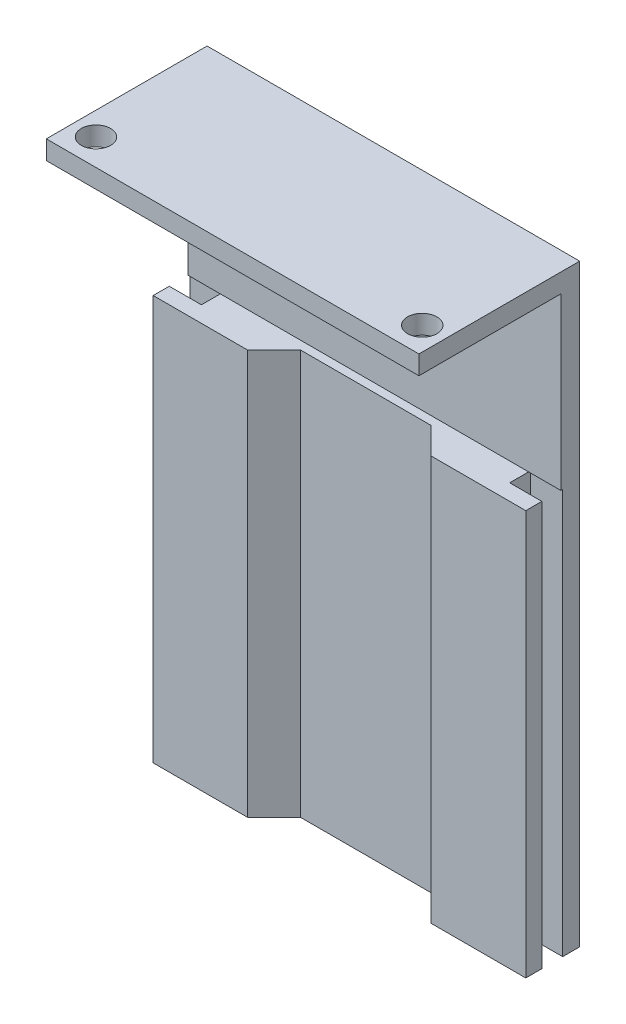
ISO-10303-21;
HEADER;
FILE_DESCRIPTION(('STEP AP214'),'2;1');
FILE_NAME('part.step','',(''),(''),'','','');
FILE_SCHEMA(('AUTOMOTIVE_DESIGN { 1 0 10303 214 1 1 1 1 }'));
ENDSEC;
DATA;
#1=APPLICATION_CONTEXT('core data for automotive mechanical design processes');
#2=APPLICATION_PROTOCOL_DEFINITION('international standard','automotive_design',2000,#1);
#3=PRODUCT_CONTEXT('',#1,'mechanical');
#4=PRODUCT('Part','Part','',(#3));
#5=PRODUCT_RELATED_PRODUCT_CATEGORY('part','',(#4));
#6=PRODUCT_DEFINITION_FORMATION('','',#4);
#7=PRODUCT_DEFINITION_CONTEXT('part definition',#1,'design');
#8=PRODUCT_DEFINITION('design','',#6,#7);
#9=PRODUCT_DEFINITION_SHAPE('','',#8);
#10=(LENGTH_UNIT() NAMED_UNIT(*) SI_UNIT(.MILLI.,.METRE.));
#11=(NAMED_UNIT(*) PLANE_ANGLE_UNIT() SI_UNIT($,.RADIAN.));
#12=(NAMED_UNIT(*) SI_UNIT($,.STERADIAN.) SOLID_ANGLE_UNIT());
#13=UNCERTAINTY_MEASURE_WITH_UNIT(LENGTH_MEASURE(1.E-05),#10,'distance_accuracy_value','');
#14=(GEOMETRIC_REPRESENTATION_CONTEXT(3) GLOBAL_UNCERTAINTY_ASSIGNED_CONTEXT((#13)) GLOBAL_UNIT_ASSIGNED_CONTEXT((#10,
#11,#12)) REPRESENTATION_CONTEXT('',''));
#15=CARTESIAN_POINT('',(0.,0.,0.));
#16=DIRECTION('',(0.,0.,1.));
#17=DIRECTION('',(1.,0.,0.));
#18=AXIS2_PLACEMENT_3D('',#15,#16,#17);
#19=CARTESIAN_POINT('',(19.7,46.,2.8));
#20=DIRECTION('',(0.,0.,-1.));
#21=DIRECTION('',(-1.,0.,0.));
#22=AXIS2_PLACEMENT_3D('',#19,#20,#21);
#23=PLANE('',#22);
#24=DIRECTION('',(0.,-1.,0.));
#25=VECTOR('',#24,1.);
#26=CARTESIAN_POINT('',(9.7,43.,2.79999999999999));
#27=LINE('',#26,#25);
#28=CARTESIAN_POINT('',(9.7,43.,2.79999999999999));
#29=VERTEX_POINT('',#28);
#30=CARTESIAN_POINT('',(9.7,0.199999999999999,2.8));
#31=VERTEX_POINT('',#30);
#32=EDGE_CURVE('E199',#29,#31,#27,.T.);
#33=ORIENTED_EDGE('',*,*,#32,.T.);
#34=DIRECTION('',(-1.,0.,0.));
#35=VECTOR('',#34,1.);
#36=CARTESIAN_POINT('',(19.7,0.2,2.8));
#37=LINE('',#36,#35);
#38=CARTESIAN_POINT('',(19.7,0.2,2.8));
#39=VERTEX_POINT('',#38);
#40=EDGE_CURVE('E183',#39,#31,#37,.T.);
#41=ORIENTED_EDGE('',*,*,#40,.F.);
#42=DIRECTION('',(0.,-1.,0.));
#43=VECTOR('',#42,1.);
#44=CARTESIAN_POINT('',(19.7,46.,2.8));
#45=LINE('',#44,#43);
#46=CARTESIAN_POINT('',(19.7,43.,2.8));
#47=VERTEX_POINT('',#46);
#48=EDGE_CURVE('E197',#47,#39,#45,.T.);
#49=ORIENTED_EDGE('',*,*,#48,.F.);
#50=DIRECTION('',(1.,0.,0.));
#51=VECTOR('',#50,1.);
#52=CARTESIAN_POINT('',(-20.,43.,2.79999999999999));
#53=LINE('',#52,#51);
#54=EDGE_CURVE('E207',#29,#47,#53,.T.);
#55=ORIENTED_EDGE('',*,*,#54,.F.);
#56=EDGE_LOOP('',(#33,#41,#49,#55));
#57=FACE_BOUND('',#56,.T.);
#58=ADVANCED_FACE('F38',(#57),#23,.F.);
#59=CARTESIAN_POINT('',(20.,63.,-0.899999999999998));
#60=DIRECTION('',(0.,0.,-1.));
#61=DIRECTION('',(-1.,0.,0.));
#62=AXIS2_PLACEMENT_3D('',#59,#60,#61);
#63=PLANE('',#62);
#64=DIRECTION('',(1.,0.,0.));
#65=VECTOR('',#64,1.);
#66=CARTESIAN_POINT('',(20.,43.,-0.899999999999998));
#67=LINE('',#66,#65);
#68=CARTESIAN_POINT('',(16.3,43.,-0.899999999999998));
#69=VERTEX_POINT('',#68);
#70=CARTESIAN_POINT('',(19.7,43.,-0.899999999999998));
#71=VERTEX_POINT('',#70);
#72=EDGE_CURVE('E267',#69,#71,#67,.T.);
#73=ORIENTED_EDGE('',*,*,#72,.T.);
#74=DIRECTION('',(0.,1.,0.));
#75=VECTOR('',#74,1.);
#76=CARTESIAN_POINT('',(19.7,63.,-0.899999999999998));
#77=LINE('',#76,#75);
#78=CARTESIAN_POINT('',(19.7,61.,-0.899999999999998));
#79=VERTEX_POINT('',#78);
#80=EDGE_CURVE('E300',#71,#79,#77,.T.);
#81=ORIENTED_EDGE('',*,*,#80,.T.);
#82=DIRECTION('',(1.,0.,0.));
#83=VECTOR('',#82,1.);
#84=CARTESIAN_POINT('',(-20.,61.,-0.899999999999998));
#85=LINE('',#84,#83);
#86=CARTESIAN_POINT('',(-19.7,61.,-0.899999999999998));
#87=VERTEX_POINT('',#86);
#88=EDGE_CURVE('E331',#87,#79,#85,.T.);
#89=ORIENTED_EDGE('',*,*,#88,.F.);
#90=DIRECTION('',(0.,-1.,0.));
#91=VECTOR('',#90,1.);
#92=CARTESIAN_POINT('',(-19.7,63.,-0.899999999999998));
#93=LINE('',#92,#91);
#94=CARTESIAN_POINT('',(-19.7,43.,-0.899999999999998));
#95=VERTEX_POINT('',#94);
#96=EDGE_CURVE('E309',#87,#95,#93,.T.);
#97=ORIENTED_EDGE('',*,*,#96,.T.);
#98=DIRECTION('',(1.,0.,0.));
#99=VECTOR('',#98,1.);
#100=CARTESIAN_POINT('',(-20.,43.,-0.899999999999998));
#101=LINE('',#100,#99);
#102=CARTESIAN_POINT('',(-16.3,43.,-0.899999999999998));
#103=VERTEX_POINT('',#102);
#104=EDGE_CURVE('E340',#95,#103,#101,.T.);
#105=ORIENTED_EDGE('',*,*,#104,.T.);
#106=EDGE_CURVE('E335',#103,#69,#101,.T.);
#107=ORIENTED_EDGE('',*,*,#106,.T.);
#108=EDGE_LOOP('',(#73,#81,#89,#97,#105,#107));
#109=FACE_BOUND('',#108,.T.);
#110=ADVANCED_FACE('F40',(#109),#63,.F.);
#111=CARTESIAN_POINT('',(-20.,63.,-2.9));
#112=DIRECTION('',(0.,0.,1.));
#113=DIRECTION('',(1.,0.,0.));
#114=AXIS2_PLACEMENT_3D('',#111,#112,#113);
#115=PLANE('',#114);
#116=DIRECTION('',(0.,-1.,0.));
#117=VECTOR('',#116,1.);
#118=CARTESIAN_POINT('',(19.7,63.,-2.9));
#119=LINE('',#118,#117);
#120=CARTESIAN_POINT('',(19.7,63.,-2.9));
#121=VERTEX_POINT('',#120);
#122=CARTESIAN_POINT('',(19.7,0.2,-2.9));
#123=VERTEX_POINT('',#122);
#124=EDGE_CURVE('E279',#121,#123,#119,.T.);
#125=ORIENTED_EDGE('',*,*,#124,.T.);
#126=DIRECTION('',(-1.,0.,0.));
#127=VECTOR('',#126,1.);
#128=CARTESIAN_POINT('',(-20.,0.200000000000006,-2.9));
#129=LINE('',#128,#127);
#130=CARTESIAN_POINT('',(-19.7,0.199999999999995,-2.9));
#131=VERTEX_POINT('',#130);
#132=EDGE_CURVE('E396',#123,#131,#129,.T.);
#133=ORIENTED_EDGE('',*,*,#132,.T.);
#134=DIRECTION('',(0.,-1.,0.));
#135=VECTOR('',#134,1.);
#136=CARTESIAN_POINT('',(-19.7,63.,-2.9));
#137=LINE('',#136,#135);
#138=CARTESIAN_POINT('',(-19.7,63.,-2.9));
#139=VERTEX_POINT('',#138);
#140=EDGE_CURVE('E278',#139,#131,#137,.T.);
#141=ORIENTED_EDGE('',*,*,#140,.F.);
#142=DIRECTION('',(-1.,0.,0.));
#143=VECTOR('',#142,1.);
#144=CARTESIAN_POINT('',(-20.,63.,-2.9));
#145=LINE('',#144,#143);
#146=EDGE_CURVE('E344',#121,#139,#145,.T.);
#147=ORIENTED_EDGE('',*,*,#146,.F.);
#148=EDGE_LOOP('',(#125,#133,#141,#147));
#149=FACE_BOUND('',#148,.T.);
#150=ADVANCED_FACE('F477',(#149),#115,.F.);
#151=CARTESIAN_POINT('',(0.,63.,0.));
#152=DIRECTION('',(0.,-1.,0.));
#153=DIRECTION('',(0.,0.,-1.));
#154=AXIS2_PLACEMENT_3D('',#151,#152,#153);
#155=PLANE('',#154);
#156=CARTESIAN_POINT('',(-17.25,63.,11.3));
#157=DIRECTION('',(0.,1.,0.));
#158=DIRECTION('',(0.,0.,1.));
#159=AXIS2_PLACEMENT_3D('',#156,#157,#158);
#160=CIRCLE('',#159,1.55);
#161=CARTESIAN_POINT('',(-17.25,63.,12.85));
#162=VERTEX_POINT('',#161);
#163=EDGE_CURVE('E318',#162,#162,#160,.T.);
#164=ORIENTED_EDGE('',*,*,#163,.F.);
#165=EDGE_LOOP('',(#164));
#166=FACE_BOUND('',#165,.T.);
#167=CARTESIAN_POINT('',(17.25,63.,11.3));
#168=DIRECTION('',(0.,1.,0.));
#169=DIRECTION('',(0.,0.,1.));
#170=AXIS2_PLACEMENT_3D('',#167,#168,#169);
#171=CIRCLE('',#170,1.55);
#172=CARTESIAN_POINT('',(17.25,63.,12.85));
#173=VERTEX_POINT('',#172);
#174=EDGE_CURVE('E317',#173,#173,#171,.T.);
#175=ORIENTED_EDGE('',*,*,#174,.F.);
#176=EDGE_LOOP('',(#175));
#177=FACE_BOUND('',#176,.T.);
#178=ORIENTED_EDGE('',*,*,#146,.T.);
#179=DIRECTION('',(0.,0.,1.));
#180=VECTOR('',#179,1.);
#181=CARTESIAN_POINT('',(-19.7,63.,14.1));
#182=LINE('',#181,#180);
#183=CARTESIAN_POINT('',(-19.7,63.,14.1));
#184=VERTEX_POINT('',#183);
#185=EDGE_CURVE('E274',#139,#184,#182,.T.);
#186=ORIENTED_EDGE('',*,*,#185,.T.);
#187=DIRECTION('',(-1.,0.,0.));
#188=VECTOR('',#187,1.);
#189=CARTESIAN_POINT('',(-20.,63.,14.1));
#190=LINE('',#189,#188);
#191=CARTESIAN_POINT('',(19.7,63.,14.1));
#192=VERTEX_POINT('',#191);
#193=EDGE_CURVE('E330',#192,#184,#190,.T.);
#194=ORIENTED_EDGE('',*,*,#193,.F.);
#195=DIRECTION('',(0.,0.,-1.));
#196=VECTOR('',#195,1.);
#197=CARTESIAN_POINT('',(19.7,63.,14.1));
#198=LINE('',#197,#196);
#199=EDGE_CURVE('E270',#192,#121,#198,.T.);
#200=ORIENTED_EDGE('',*,*,#199,.T.);
#201=EDGE_LOOP('',(#178,#186,#194,#200));
#202=FACE_BOUND('',#201,.T.);
#203=ADVANCED_FACE('F528',(#166,#177,#202),#155,.F.);
#204=CARTESIAN_POINT('',(-20.,43.,2.9));
#205=DIRECTION('',(0.,-1.,0.));
#206=DIRECTION('',(0.,0.,-1.));
#207=AXIS2_PLACEMENT_3D('',#204,#205,#206);
#208=PLANE('',#207);
#209=DIRECTION('',(1.,0.,0.));
#210=VECTOR('',#209,1.);
#211=CARTESIAN_POINT('',(-6.89999999999993,43.,0.));
#212=LINE('',#211,#210);
#213=CARTESIAN_POINT('',(-6.89999999999993,43.,0.));
#214=VERTEX_POINT('',#213);
#215=CARTESIAN_POINT('',(6.90000000000005,43.,0.));
#216=VERTEX_POINT('',#215);
#217=EDGE_CURVE('E407',#214,#216,#212,.T.);
#218=ORIENTED_EDGE('',*,*,#217,.T.);
#219=DIRECTION('',(0.707106781186541,0.,0.707106781186554));
#220=VECTOR('',#219,1.);
#221=CARTESIAN_POINT('',(9.7,43.,2.79999999999999));
#222=LINE('',#221,#220);
#223=EDGE_CURVE('E410',#216,#29,#222,.T.);
#224=ORIENTED_EDGE('',*,*,#223,.T.);
#225=ORIENTED_EDGE('',*,*,#54,.T.);
#226=DIRECTION('',(0.,0.,-1.));
#227=VECTOR('',#226,1.);
#228=CARTESIAN_POINT('',(19.7,43.,2.90000000000001));
#229=LINE('',#228,#227);
#230=CARTESIAN_POINT('',(19.7,43.,1.1));
#231=VERTEX_POINT('',#230);
#232=EDGE_CURVE('E205',#47,#231,#229,.T.);
#233=ORIENTED_EDGE('',*,*,#232,.T.);
#234=DIRECTION('',(-1.,0.,0.));
#235=VECTOR('',#234,1.);
#236=CARTESIAN_POINT('',(19.9,43.,1.1));
#237=LINE('',#236,#235);
#238=CARTESIAN_POINT('',(16.3,43.,1.1));
#239=VERTEX_POINT('',#238);
#240=EDGE_CURVE('E231',#231,#239,#237,.T.);
#241=ORIENTED_EDGE('',*,*,#240,.T.);
#242=DIRECTION('',(0.,0.,-1.));
#243=VECTOR('',#242,1.);
#244=CARTESIAN_POINT('',(16.3,43.,1.1));
#245=LINE('',#244,#243);
#246=EDGE_CURVE('E222',#239,#69,#245,.T.);
#247=ORIENTED_EDGE('',*,*,#246,.T.);
#248=ORIENTED_EDGE('',*,*,#106,.F.);
#249=DIRECTION('',(0.,0.,1.));
#250=VECTOR('',#249,1.);
#251=CARTESIAN_POINT('',(-16.3,43.,1.1));
#252=LINE('',#251,#250);
#253=CARTESIAN_POINT('',(-16.3,43.,1.1));
#254=VERTEX_POINT('',#253);
#255=EDGE_CURVE('E246',#103,#254,#252,.T.);
#256=ORIENTED_EDGE('',*,*,#255,.T.);
#257=DIRECTION('',(-1.,0.,0.));
#258=VECTOR('',#257,1.);
#259=CARTESIAN_POINT('',(-16.3,43.,1.1));
#260=LINE('',#259,#258);
#261=CARTESIAN_POINT('',(-19.7,43.,1.1));
#262=VERTEX_POINT('',#261);
#263=EDGE_CURVE('E251',#254,#262,#260,.T.);
#264=ORIENTED_EDGE('',*,*,#263,.T.);
#265=DIRECTION('',(0.,0.,1.));
#266=VECTOR('',#265,1.);
#267=CARTESIAN_POINT('',(-19.7,43.,2.9));
#268=LINE('',#267,#266);
#269=CARTESIAN_POINT('',(-19.7,43.,2.79999999999999));
#270=VERTEX_POINT('',#269);
#271=EDGE_CURVE('E313',#262,#270,#268,.T.);
#272=ORIENTED_EDGE('',*,*,#271,.T.);
#273=CARTESIAN_POINT('',(-9.69999999999999,43.,2.79999999999999));
#274=VERTEX_POINT('',#273);
#275=EDGE_CURVE('E211',#270,#274,#53,.T.);
#276=ORIENTED_EDGE('',*,*,#275,.T.);
#277=DIRECTION('',(0.707106781186556,0.,-0.707106781186539));
#278=VECTOR('',#277,1.);
#279=CARTESIAN_POINT('',(-9.69999999999999,43.,2.79999999999999));
#280=LINE('',#279,#278);
#281=EDGE_CURVE('E61',#274,#214,#280,.T.);
#282=ORIENTED_EDGE('',*,*,#281,.T.);
#283=EDGE_LOOP('',(#218,#224,#225,#233,#241,#247,#248,#256,#264,#272,#276,#282));
#284=FACE_BOUND('',#283,.T.);
#285=ADVANCED_FACE('F380',(#284),#208,.F.);
#286=CARTESIAN_POINT('',(-20.,61.,14.1));
#287=DIRECTION('',(0.,1.,0.));
#288=DIRECTION('',(0.,0.,1.));
#289=AXIS2_PLACEMENT_3D('',#286,#287,#288);
#290=PLANE('',#289);
#291=CARTESIAN_POINT('',(-17.25,61.,11.3));
#292=DIRECTION('',(0.,1.,0.));
#293=DIRECTION('',(0.,0.,1.));
#294=AXIS2_PLACEMENT_3D('',#291,#292,#293);
#295=CIRCLE('',#294,1.55);
#296=CARTESIAN_POINT('',(-17.25,61.,12.85));
#297=VERTEX_POINT('',#296);
#298=EDGE_CURVE('E339',#297,#297,#295,.T.);
#299=ORIENTED_EDGE('',*,*,#298,.T.);
#300=EDGE_LOOP('',(#299));
#301=FACE_BOUND('',#300,.T.);
#302=CARTESIAN_POINT('',(17.25,61.,11.3));
#303=DIRECTION('',(0.,1.,0.));
#304=DIRECTION('',(0.,0.,1.));
#305=AXIS2_PLACEMENT_3D('',#302,#303,#304);
#306=CIRCLE('',#305,1.55);
#307=CARTESIAN_POINT('',(17.25,61.,12.85));
#308=VERTEX_POINT('',#307);
#309=EDGE_CURVE('E322',#308,#308,#306,.T.);
#310=ORIENTED_EDGE('',*,*,#309,.T.);
#311=EDGE_LOOP('',(#310));
#312=FACE_BOUND('',#311,.T.);
#313=DIRECTION('',(1.,0.,0.));
#314=VECTOR('',#313,1.);
#315=CARTESIAN_POINT('',(-20.,61.,14.1));
#316=LINE('',#315,#314);
#317=CARTESIAN_POINT('',(-19.7,61.,14.1));
#318=VERTEX_POINT('',#317);
#319=CARTESIAN_POINT('',(19.7,61.,14.1));
#320=VERTEX_POINT('',#319);
#321=EDGE_CURVE('E326',#318,#320,#316,.T.);
#322=ORIENTED_EDGE('',*,*,#321,.F.);
#323=DIRECTION('',(0.,0.,-1.));
#324=VECTOR('',#323,1.);
#325=CARTESIAN_POINT('',(-19.7,61.,14.1));
#326=LINE('',#325,#324);
#327=EDGE_CURVE('E305',#318,#87,#326,.T.);
#328=ORIENTED_EDGE('',*,*,#327,.T.);
#329=ORIENTED_EDGE('',*,*,#88,.T.);
#330=DIRECTION('',(0.,0.,1.));
#331=VECTOR('',#330,1.);
#332=CARTESIAN_POINT('',(19.7,61.,14.1));
#333=LINE('',#332,#331);
#334=EDGE_CURVE('E284',#79,#320,#333,.T.);
#335=ORIENTED_EDGE('',*,*,#334,.T.);
#336=EDGE_LOOP('',(#322,#328,#329,#335));
#337=FACE_BOUND('',#336,.T.);
#338=ADVANCED_FACE('F521',(#301,#312,#337),#290,.F.);
#339=CARTESIAN_POINT('',(0.,0.,14.1));
#340=DIRECTION('',(0.,0.,1.));
#341=DIRECTION('',(1.,0.,0.));
#342=AXIS2_PLACEMENT_3D('',#339,#340,#341);
#343=PLANE('',#342);
#344=DIRECTION('',(0.,-1.,0.));
#345=VECTOR('',#344,1.);
#346=CARTESIAN_POINT('',(-19.7,63.,14.1));
#347=LINE('',#346,#345);
#348=EDGE_CURVE('E280',#184,#318,#347,.T.);
#349=ORIENTED_EDGE('',*,*,#348,.T.);
#350=ORIENTED_EDGE('',*,*,#321,.T.);
#351=DIRECTION('',(0.,-1.,0.));
#352=VECTOR('',#351,1.);
#353=CARTESIAN_POINT('',(19.7,63.,14.1));
#354=LINE('',#353,#352);
#355=EDGE_CURVE('E291',#192,#320,#354,.T.);
#356=ORIENTED_EDGE('',*,*,#355,.F.);
#357=ORIENTED_EDGE('',*,*,#193,.T.);
#358=EDGE_LOOP('',(#349,#350,#356,#357));
#359=FACE_BOUND('',#358,.T.);
#360=ADVANCED_FACE('F517',(#359),#343,.T.);
#361=CARTESIAN_POINT('',(17.25,60.,11.3));
#362=DIRECTION('',(0.,1.,0.));
#363=DIRECTION('',(0.,0.,1.));
#364=AXIS2_PLACEMENT_3D('',#361,#362,#363);
#365=CYLINDRICAL_SURFACE('',#364,1.55);
#366=ORIENTED_EDGE('',*,*,#174,.T.);
#367=EDGE_LOOP('',(#366));
#368=FACE_BOUND('',#367,.T.);
#369=ORIENTED_EDGE('',*,*,#309,.F.);
#370=EDGE_LOOP('',(#369));
#371=FACE_BOUND('',#370,.T.);
#372=ADVANCED_FACE('F513',(#368,#371),#365,.F.);
#373=CARTESIAN_POINT('',(-17.25,60.,11.3));
#374=DIRECTION('',(0.,1.,0.));
#375=DIRECTION('',(0.,0.,1.));
#376=AXIS2_PLACEMENT_3D('',#373,#374,#375);
#377=CYLINDRICAL_SURFACE('',#376,1.55);
#378=ORIENTED_EDGE('',*,*,#163,.T.);
#379=EDGE_LOOP('',(#378));
#380=FACE_BOUND('',#379,.T.);
#381=ORIENTED_EDGE('',*,*,#298,.F.);
#382=EDGE_LOOP('',(#381));
#383=FACE_BOUND('',#382,.T.);
#384=ADVANCED_FACE('F510',(#380,#383),#377,.F.);
#385=CARTESIAN_POINT('',(19.7,63.,14.1));
#386=DIRECTION('',(-1.,0.,0.));
#387=DIRECTION('',(0.,0.,1.));
#388=AXIS2_PLACEMENT_3D('',#385,#386,#387);
#389=PLANE('',#388);
#390=DIRECTION('',(0.,-1.,0.));
#391=VECTOR('',#390,1.);
#392=CARTESIAN_POINT('',(19.7,63.,-1.1));
#393=LINE('',#392,#391);
#394=CARTESIAN_POINT('',(19.7,43.,-1.1));
#395=VERTEX_POINT('',#394);
#396=CARTESIAN_POINT('',(19.7,0.2,-1.1));
#397=VERTEX_POINT('',#396);
#398=EDGE_CURVE('E364',#395,#397,#393,.T.);
#399=ORIENTED_EDGE('',*,*,#398,.T.);
#400=DIRECTION('',(0.,0.,1.));
#401=VECTOR('',#400,1.);
#402=CARTESIAN_POINT('',(19.7,0.2,-7.2));
#403=LINE('',#402,#401);
#404=EDGE_CURVE('E191',#123,#397,#403,.T.);
#405=ORIENTED_EDGE('',*,*,#404,.F.);
#406=ORIENTED_EDGE('',*,*,#124,.F.);
#407=ORIENTED_EDGE('',*,*,#199,.F.);
#408=ORIENTED_EDGE('',*,*,#355,.T.);
#409=ORIENTED_EDGE('',*,*,#334,.F.);
#410=ORIENTED_EDGE('',*,*,#80,.F.);
#411=DIRECTION('',(0.,0.,-1.));
#412=VECTOR('',#411,1.);
#413=CARTESIAN_POINT('',(19.7,43.,14.1));
#414=LINE('',#413,#412);
#415=EDGE_CURVE('E266',#71,#395,#414,.T.);
#416=ORIENTED_EDGE('',*,*,#415,.T.);
#417=EDGE_LOOP('',(#399,#405,#406,#407,#408,#409,#410,#416));
#418=FACE_BOUND('',#417,.T.);
#419=ADVANCED_FACE('F446',(#418),#389,.F.);
#420=CARTESIAN_POINT('',(-19.7,63.,14.1));
#421=DIRECTION('',(1.,0.,0.));
#422=DIRECTION('',(0.,0.,-1.));
#423=AXIS2_PLACEMENT_3D('',#420,#421,#422);
#424=PLANE('',#423);
#425=ORIENTED_EDGE('',*,*,#140,.T.);
#426=DIRECTION('',(0.,0.,1.));
#427=VECTOR('',#426,1.);
#428=CARTESIAN_POINT('',(-19.7,0.199999999999995,-7.2));
#429=LINE('',#428,#427);
#430=CARTESIAN_POINT('',(-19.7,0.199999999999995,-1.1));
#431=VERTEX_POINT('',#430);
#432=EDGE_CURVE('E426',#131,#431,#429,.T.);
#433=ORIENTED_EDGE('',*,*,#432,.T.);
#434=DIRECTION('',(0.,1.,0.));
#435=VECTOR('',#434,1.);
#436=CARTESIAN_POINT('',(-19.7,63.,-1.1));
#437=LINE('',#436,#435);
#438=CARTESIAN_POINT('',(-19.7,43.,-1.1));
#439=VERTEX_POINT('',#438);
#440=EDGE_CURVE('E361',#431,#439,#437,.T.);
#441=ORIENTED_EDGE('',*,*,#440,.T.);
#442=DIRECTION('',(0.,0.,1.));
#443=VECTOR('',#442,1.);
#444=CARTESIAN_POINT('',(-19.7,43.,14.1));
#445=LINE('',#444,#443);
#446=EDGE_CURVE('E240',#439,#95,#445,.T.);
#447=ORIENTED_EDGE('',*,*,#446,.T.);
#448=ORIENTED_EDGE('',*,*,#96,.F.);
#449=ORIENTED_EDGE('',*,*,#327,.F.);
#450=ORIENTED_EDGE('',*,*,#348,.F.);
#451=ORIENTED_EDGE('',*,*,#185,.F.);
#452=EDGE_LOOP('',(#425,#433,#441,#447,#448,#449,#450,#451));
#453=FACE_BOUND('',#452,.T.);
#454=ADVANCED_FACE('F507',(#453),#424,.F.);
#455=ORIENTED_EDGE('',*,*,#48,.T.);
#456=CARTESIAN_POINT('',(19.7,0.2,1.1));
#457=VERTEX_POINT('',#456);
#458=EDGE_CURVE('E180',#457,#39,#403,.T.);
#459=ORIENTED_EDGE('',*,*,#458,.F.);
#460=DIRECTION('',(0.,1.,0.));
#461=VECTOR('',#460,1.);
#462=CARTESIAN_POINT('',(19.7,63.,1.1));
#463=LINE('',#462,#461);
#464=EDGE_CURVE('E358',#457,#231,#463,.T.);
#465=ORIENTED_EDGE('',*,*,#464,.T.);
#466=ORIENTED_EDGE('',*,*,#232,.F.);
#467=EDGE_LOOP('',(#455,#459,#465,#466));
#468=FACE_BOUND('',#467,.T.);
#469=ADVANCED_FACE('F203',(#468),#389,.F.);
#470=DIRECTION('',(0.,-1.,0.));
#471=VECTOR('',#470,1.);
#472=CARTESIAN_POINT('',(-19.7,63.,1.1));
#473=LINE('',#472,#471);
#474=CARTESIAN_POINT('',(-19.7,0.199999999999995,1.1));
#475=VERTEX_POINT('',#474);
#476=EDGE_CURVE('E348',#262,#475,#473,.T.);
#477=ORIENTED_EDGE('',*,*,#476,.T.);
#478=CARTESIAN_POINT('',(-19.7,0.199999999999995,2.8));
#479=VERTEX_POINT('',#478);
#480=EDGE_CURVE('E374',#475,#479,#429,.T.);
#481=ORIENTED_EDGE('',*,*,#480,.T.);
#482=DIRECTION('',(0.,1.,0.));
#483=VECTOR('',#482,1.);
#484=CARTESIAN_POINT('',(-19.7,63.,2.79999999999999));
#485=LINE('',#484,#483);
#486=EDGE_CURVE('E47',#479,#270,#485,.T.);
#487=ORIENTED_EDGE('',*,*,#486,.T.);
#488=ORIENTED_EDGE('',*,*,#271,.F.);
#489=EDGE_LOOP('',(#477,#481,#487,#488));
#490=FACE_BOUND('',#489,.T.);
#491=ADVANCED_FACE('F373',(#490),#424,.F.);
#492=CARTESIAN_POINT('',(-16.3,43.,-1.1));
#493=DIRECTION('',(0.,0.,-1.));
#494=DIRECTION('',(-1.,0.,0.));
#495=AXIS2_PLACEMENT_3D('',#492,#493,#494);
#496=PLANE('',#495);
#497=ORIENTED_EDGE('',*,*,#440,.F.);
#498=DIRECTION('',(1.,0.,0.));
#499=VECTOR('',#498,1.);
#500=CARTESIAN_POINT('',(-16.3,0.199999999999992,-1.1));
#501=LINE('',#500,#499);
#502=CARTESIAN_POINT('',(-16.3,0.199999999999992,-1.1));
#503=VERTEX_POINT('',#502);
#504=EDGE_CURVE('E390',#431,#503,#501,.T.);
#505=ORIENTED_EDGE('',*,*,#504,.T.);
#506=DIRECTION('',(0.,-1.,0.));
#507=VECTOR('',#506,1.);
#508=CARTESIAN_POINT('',(-16.3,43.,-1.1));
#509=LINE('',#508,#507);
#510=CARTESIAN_POINT('',(-16.3,43.,-1.1));
#511=VERTEX_POINT('',#510);
#512=EDGE_CURVE('E255',#511,#503,#509,.T.);
#513=ORIENTED_EDGE('',*,*,#512,.F.);
#514=DIRECTION('',(1.,0.,0.));
#515=VECTOR('',#514,1.);
#516=CARTESIAN_POINT('',(-16.3,43.,-1.1));
#517=LINE('',#516,#515);
#518=EDGE_CURVE('E221',#439,#511,#517,.T.);
#519=ORIENTED_EDGE('',*,*,#518,.F.);
#520=EDGE_LOOP('',(#497,#505,#513,#519));
#521=FACE_BOUND('',#520,.T.);
#522=ADVANCED_FACE('F498',(#521),#496,.F.);
#523=CARTESIAN_POINT('',(-16.3,43.,1.1));
#524=DIRECTION('',(0.,0.,1.));
#525=DIRECTION('',(1.,0.,0.));
#526=AXIS2_PLACEMENT_3D('',#523,#524,#525);
#527=PLANE('',#526);
#528=DIRECTION('',(0.,-1.,0.));
#529=VECTOR('',#528,1.);
#530=CARTESIAN_POINT('',(-16.3,43.,1.1));
#531=LINE('',#530,#529);
#532=CARTESIAN_POINT('',(-16.3,0.199999999999992,1.1));
#533=VERTEX_POINT('',#532);
#534=EDGE_CURVE('E256',#254,#533,#531,.T.);
#535=ORIENTED_EDGE('',*,*,#534,.T.);
#536=DIRECTION('',(-1.,0.,0.));
#537=VECTOR('',#536,1.);
#538=CARTESIAN_POINT('',(-16.3,0.199999999999992,1.1));
#539=LINE('',#538,#537);
#540=EDGE_CURVE('E387',#533,#475,#539,.T.);
#541=ORIENTED_EDGE('',*,*,#540,.T.);
#542=ORIENTED_EDGE('',*,*,#476,.F.);
#543=ORIENTED_EDGE('',*,*,#263,.F.);
#544=EDGE_LOOP('',(#535,#541,#542,#543));
#545=FACE_BOUND('',#544,.T.);
#546=ADVANCED_FACE('F385',(#545),#527,.F.);
#547=CARTESIAN_POINT('',(0.,43.,0.));
#548=DIRECTION('',(0.,1.,0.));
#549=DIRECTION('',(0.,0.,1.));
#550=AXIS2_PLACEMENT_3D('',#547,#548,#549);
#551=PLANE('',#550);
#552=ORIENTED_EDGE('',*,*,#446,.F.);
#553=ORIENTED_EDGE('',*,*,#518,.T.);
#554=EDGE_CURVE('E247',#511,#103,#252,.T.);
#555=ORIENTED_EDGE('',*,*,#554,.T.);
#556=ORIENTED_EDGE('',*,*,#104,.F.);
#557=EDGE_LOOP('',(#552,#553,#555,#556));
#558=FACE_BOUND('',#557,.T.);
#559=ADVANCED_FACE('F491',(#558),#551,.F.);
#560=CARTESIAN_POINT('',(-16.3,43.,1.1));
#561=DIRECTION('',(1.,0.,0.));
#562=DIRECTION('',(0.,0.,-1.));
#563=AXIS2_PLACEMENT_3D('',#560,#561,#562);
#564=PLANE('',#563);
#565=ORIENTED_EDGE('',*,*,#512,.T.);
#566=DIRECTION('',(0.,0.,1.));
#567=VECTOR('',#566,1.);
#568=CARTESIAN_POINT('',(-16.3,0.199999999999992,1.1));
#569=LINE('',#568,#567);
#570=EDGE_CURVE('E391',#503,#533,#569,.T.);
#571=ORIENTED_EDGE('',*,*,#570,.T.);
#572=ORIENTED_EDGE('',*,*,#534,.F.);
#573=ORIENTED_EDGE('',*,*,#255,.F.);
#574=ORIENTED_EDGE('',*,*,#554,.F.);
#575=EDGE_LOOP('',(#565,#571,#572,#573,#574));
#576=FACE_BOUND('',#575,.T.);
#577=ADVANCED_FACE('F494',(#576),#564,.F.);
#578=CARTESIAN_POINT('',(19.9,43.,-1.1));
#579=DIRECTION('',(0.,0.,-1.));
#580=DIRECTION('',(-1.,0.,0.));
#581=AXIS2_PLACEMENT_3D('',#578,#579,#580);
#582=PLANE('',#581);
#583=DIRECTION('',(0.,-1.,0.));
#584=VECTOR('',#583,1.);
#585=CARTESIAN_POINT('',(16.3,43.,-1.1));
#586=LINE('',#585,#584);
#587=CARTESIAN_POINT('',(16.3,43.,-1.1));
#588=VERTEX_POINT('',#587);
#589=CARTESIAN_POINT('',(16.3,0.199999999999999,-1.1));
#590=VERTEX_POINT('',#589);
#591=EDGE_CURVE('E235',#588,#590,#586,.T.);
#592=ORIENTED_EDGE('',*,*,#591,.T.);
#593=DIRECTION('',(1.,0.,0.));
#594=VECTOR('',#593,1.);
#595=CARTESIAN_POINT('',(19.9,0.199999999999999,-1.1));
#596=LINE('',#595,#594);
#597=EDGE_CURVE('E398',#590,#397,#596,.T.);
#598=ORIENTED_EDGE('',*,*,#597,.T.);
#599=ORIENTED_EDGE('',*,*,#398,.F.);
#600=DIRECTION('',(1.,0.,0.));
#601=VECTOR('',#600,1.);
#602=CARTESIAN_POINT('',(19.9,43.,-1.1));
#603=LINE('',#602,#601);
#604=EDGE_CURVE('E226',#588,#395,#603,.T.);
#605=ORIENTED_EDGE('',*,*,#604,.F.);
#606=EDGE_LOOP('',(#592,#598,#599,#605));
#607=FACE_BOUND('',#606,.T.);
#608=ADVANCED_FACE('F441',(#607),#582,.F.);
#609=CARTESIAN_POINT('',(19.9,43.,1.1));
#610=DIRECTION('',(0.,0.,1.));
#611=DIRECTION('',(1.,0.,0.));
#612=AXIS2_PLACEMENT_3D('',#609,#610,#611);
#613=PLANE('',#612);
#614=ORIENTED_EDGE('',*,*,#464,.F.);
#615=DIRECTION('',(-1.,0.,0.));
#616=VECTOR('',#615,1.);
#617=CARTESIAN_POINT('',(19.9,0.199999999999999,1.1));
#618=LINE('',#617,#616);
#619=CARTESIAN_POINT('',(16.3,0.199999999999999,1.1));
#620=VERTEX_POINT('',#619);
#621=EDGE_CURVE('E186',#457,#620,#618,.T.);
#622=ORIENTED_EDGE('',*,*,#621,.T.);
#623=DIRECTION('',(0.,-1.,0.));
#624=VECTOR('',#623,1.);
#625=CARTESIAN_POINT('',(16.3,43.,1.1));
#626=LINE('',#625,#624);
#627=EDGE_CURVE('E236',#239,#620,#626,.T.);
#628=ORIENTED_EDGE('',*,*,#627,.F.);
#629=ORIENTED_EDGE('',*,*,#240,.F.);
#630=EDGE_LOOP('',(#614,#622,#628,#629));
#631=FACE_BOUND('',#630,.T.);
#632=ADVANCED_FACE('F458',(#631),#613,.F.);
#633=CARTESIAN_POINT('',(0.,43.,0.));
#634=DIRECTION('',(0.,1.,0.));
#635=DIRECTION('',(0.,0.,1.));
#636=AXIS2_PLACEMENT_3D('',#633,#634,#635);
#637=PLANE('',#636);
#638=EDGE_CURVE('E227',#69,#588,#245,.T.);
#639=ORIENTED_EDGE('',*,*,#638,.T.);
#640=ORIENTED_EDGE('',*,*,#604,.T.);
#641=ORIENTED_EDGE('',*,*,#415,.F.);
#642=ORIENTED_EDGE('',*,*,#72,.F.);
#643=EDGE_LOOP('',(#639,#640,#641,#642));
#644=FACE_BOUND('',#643,.T.);
#645=ADVANCED_FACE('F451',(#644),#637,.F.);
#646=CARTESIAN_POINT('',(16.3,43.,1.1));
#647=DIRECTION('',(-1.,0.,0.));
#648=DIRECTION('',(0.,0.,1.));
#649=AXIS2_PLACEMENT_3D('',#646,#647,#648);
#650=PLANE('',#649);
#651=ORIENTED_EDGE('',*,*,#627,.T.);
#652=DIRECTION('',(0.,0.,-1.));
#653=VECTOR('',#652,1.);
#654=CARTESIAN_POINT('',(16.3,0.199999999999999,1.1));
#655=LINE('',#654,#653);
#656=EDGE_CURVE('E433',#620,#590,#655,.T.);
#657=ORIENTED_EDGE('',*,*,#656,.T.);
#658=ORIENTED_EDGE('',*,*,#591,.F.);
#659=ORIENTED_EDGE('',*,*,#638,.F.);
#660=ORIENTED_EDGE('',*,*,#246,.F.);
#661=EDGE_LOOP('',(#651,#657,#658,#659,#660));
#662=FACE_BOUND('',#661,.T.);
#663=ADVANCED_FACE('F456',(#662),#650,.F.);
#664=ORIENTED_EDGE('',*,*,#486,.F.);
#665=CARTESIAN_POINT('',(-9.69999999999999,0.199999999999996,2.8));
#666=VERTEX_POINT('',#665);
#667=EDGE_CURVE('E201',#666,#479,#37,.T.);
#668=ORIENTED_EDGE('',*,*,#667,.F.);
#669=DIRECTION('',(0.,-1.,0.));
#670=VECTOR('',#669,1.);
#671=CARTESIAN_POINT('',(-9.69999999999999,43.,2.79999999999999));
#672=LINE('',#671,#670);
#673=EDGE_CURVE('E216',#274,#666,#672,.T.);
#674=ORIENTED_EDGE('',*,*,#673,.F.);
#675=ORIENTED_EDGE('',*,*,#275,.F.);
#676=EDGE_LOOP('',(#664,#668,#674,#675));
#677=FACE_BOUND('',#676,.T.);
#678=ADVANCED_FACE('F377',(#677),#23,.F.);
#679=CARTESIAN_POINT('',(9.7,43.,2.79999999999999));
#680=DIRECTION('',(0.707106781186554,0.,-0.707106781186541));
#681=DIRECTION('',(-0.707106781186541,0.,-0.707106781186554));
#682=AXIS2_PLACEMENT_3D('',#679,#680,#681);
#683=PLANE('',#682);
#684=DIRECTION('',(0.,-1.,0.));
#685=VECTOR('',#684,1.);
#686=CARTESIAN_POINT('',(6.90000000000005,43.,0.));
#687=LINE('',#686,#685);
#688=CARTESIAN_POINT('',(6.90000000000005,0.199999999999999,0.));
#689=VERTEX_POINT('',#688);
#690=EDGE_CURVE('E213',#216,#689,#687,.T.);
#691=ORIENTED_EDGE('',*,*,#690,.T.);
#692=DIRECTION('',(0.707106781186541,0.,0.707106781186554));
#693=VECTOR('',#692,1.);
#694=CARTESIAN_POINT('',(9.7,0.199999999999999,2.8));
#695=LINE('',#694,#693);
#696=EDGE_CURVE('E430',#689,#31,#695,.T.);
#697=ORIENTED_EDGE('',*,*,#696,.T.);
#698=ORIENTED_EDGE('',*,*,#32,.F.);
#699=ORIENTED_EDGE('',*,*,#223,.F.);
#700=EDGE_LOOP('',(#691,#697,#698,#699));
#701=FACE_BOUND('',#700,.T.);
#702=ADVANCED_FACE('F462',(#701),#683,.F.);
#703=CARTESIAN_POINT('',(6.90000000000005,43.,0.));
#704=DIRECTION('',(0.,0.,-1.));
#705=DIRECTION('',(-1.,0.,0.));
#706=AXIS2_PLACEMENT_3D('',#703,#704,#705);
#707=PLANE('',#706);
#708=DIRECTION('',(0.,-1.,0.));
#709=VECTOR('',#708,1.);
#710=CARTESIAN_POINT('',(-6.89999999999993,43.,0.));
#711=LINE('',#710,#709);
#712=CARTESIAN_POINT('',(-6.89999999999993,0.199999999999992,0.));
#713=VERTEX_POINT('',#712);
#714=EDGE_CURVE('E416',#214,#713,#711,.T.);
#715=ORIENTED_EDGE('',*,*,#714,.T.);
#716=DIRECTION('',(1.,0.,0.));
#717=VECTOR('',#716,1.);
#718=CARTESIAN_POINT('',(6.90000000000006,0.199999999999999,0.));
#719=LINE('',#718,#717);
#720=EDGE_CURVE('E54',#713,#689,#719,.T.);
#721=ORIENTED_EDGE('',*,*,#720,.T.);
#722=ORIENTED_EDGE('',*,*,#690,.F.);
#723=ORIENTED_EDGE('',*,*,#217,.F.);
#724=EDGE_LOOP('',(#715,#721,#722,#723));
#725=FACE_BOUND('',#724,.T.);
#726=ADVANCED_FACE('F463',(#725),#707,.F.);
#727=CARTESIAN_POINT('',(-9.69999999999999,43.,2.79999999999999));
#728=DIRECTION('',(-0.707106781186539,0.,-0.707106781186556));
#729=DIRECTION('',(-0.707106781186556,0.,0.707106781186539));
#730=AXIS2_PLACEMENT_3D('',#727,#728,#729);
#731=PLANE('',#730);
#732=ORIENTED_EDGE('',*,*,#673,.T.);
#733=DIRECTION('',(0.707106781186556,0.,-0.707106781186539));
#734=VECTOR('',#733,1.);
#735=CARTESIAN_POINT('',(-9.69999999999999,0.199999999999992,2.79999999999999));
#736=LINE('',#735,#734);
#737=EDGE_CURVE('E11',#666,#713,#736,.T.);
#738=ORIENTED_EDGE('',*,*,#737,.T.);
#739=ORIENTED_EDGE('',*,*,#714,.F.);
#740=ORIENTED_EDGE('',*,*,#281,.F.);
#741=EDGE_LOOP('',(#732,#738,#739,#740));
#742=FACE_BOUND('',#741,.T.);
#743=ADVANCED_FACE('F422',(#742),#731,.F.);
#744=CARTESIAN_POINT('',(19.7,0.2,-7.2));
#745=DIRECTION('',(0.,1.,0.));
#746=DIRECTION('',(-1.,0.,0.));
#747=AXIS2_PLACEMENT_3D('',#744,#745,#746);
#748=PLANE('',#747);
#749=ORIENTED_EDGE('',*,*,#404,.T.);
#750=ORIENTED_EDGE('',*,*,#597,.F.);
#751=ORIENTED_EDGE('',*,*,#656,.F.);
#752=ORIENTED_EDGE('',*,*,#621,.F.);
#753=ORIENTED_EDGE('',*,*,#458,.T.);
#754=ORIENTED_EDGE('',*,*,#40,.T.);
#755=ORIENTED_EDGE('',*,*,#696,.F.);
#756=ORIENTED_EDGE('',*,*,#720,.F.);
#757=ORIENTED_EDGE('',*,*,#737,.F.);
#758=ORIENTED_EDGE('',*,*,#667,.T.);
#759=ORIENTED_EDGE('',*,*,#480,.F.);
#760=ORIENTED_EDGE('',*,*,#540,.F.);
#761=ORIENTED_EDGE('',*,*,#570,.F.);
#762=ORIENTED_EDGE('',*,*,#504,.F.);
#763=ORIENTED_EDGE('',*,*,#432,.F.);
#764=ORIENTED_EDGE('',*,*,#132,.F.);
#765=EDGE_LOOP('',(#749,#750,#751,#752,#753,#754,#755,#756,#757,#758,#759,#760,#761,#762,#763,#764));
#766=FACE_BOUND('',#765,.T.);
#767=ADVANCED_FACE('F182',(#766),#748,.F.);
#768=CLOSED_SHELL('',(#58,#110,#150,#203,#285,#338,#360,#372,#384,#419,#454,#469,#491,#522,#546,
#559,#577,#608,#632,#645,#663,#678,#702,#726,#743,#767));
#769=MANIFOLD_SOLID_BREP('B2',#768);
#770=ADVANCED_BREP_SHAPE_REPRESENTATION('',(#18,#769),#14);
#771=SHAPE_DEFINITION_REPRESENTATION(#9,#770);
ENDSEC;
END-ISO-10303-21;
